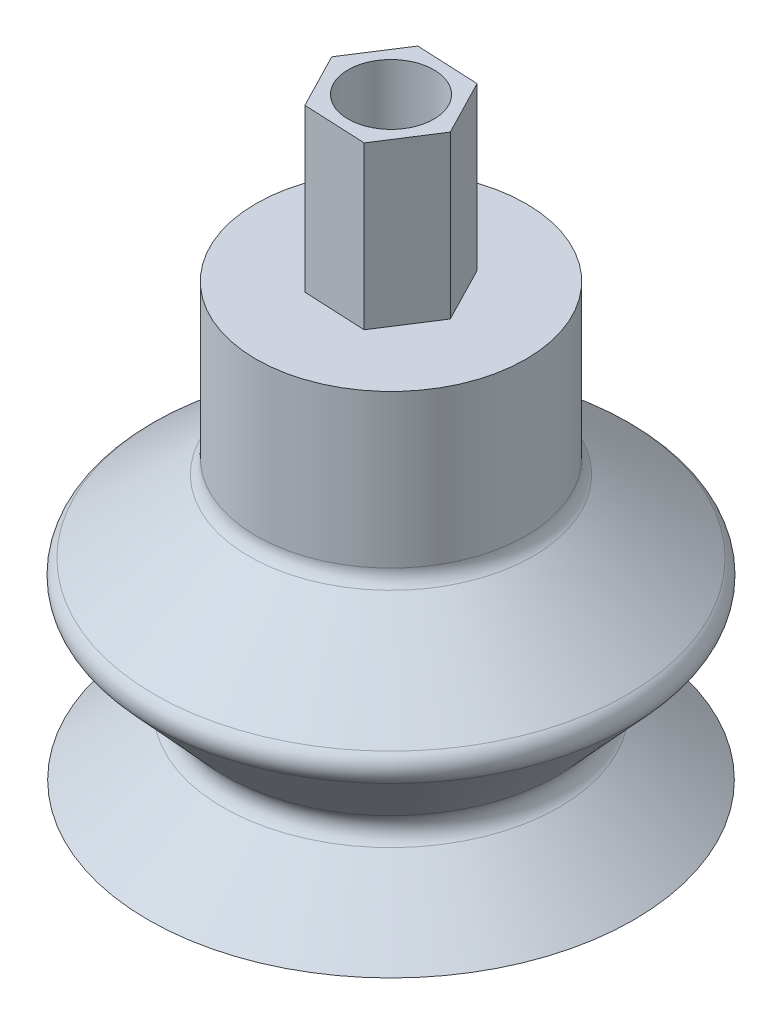
ISO-10303-21;
HEADER;
FILE_DESCRIPTION(('STEP AP214'),'2;1');
FILE_NAME('part.step','',(''),(''),'','','');
FILE_SCHEMA(('AUTOMOTIVE_DESIGN { 1 0 10303 214 1 1 1 1 }'));
ENDSEC;
DATA;
#1=APPLICATION_CONTEXT('core data for automotive mechanical design processes');
#2=APPLICATION_PROTOCOL_DEFINITION('international standard','automotive_design',2000,#1);
#3=PRODUCT_CONTEXT('',#1,'mechanical');
#4=PRODUCT('Part','Part','',(#3));
#5=PRODUCT_RELATED_PRODUCT_CATEGORY('part','',(#4));
#6=PRODUCT_DEFINITION_FORMATION('','',#4);
#7=PRODUCT_DEFINITION_CONTEXT('part definition',#1,'design');
#8=PRODUCT_DEFINITION('design','',#6,#7);
#9=PRODUCT_DEFINITION_SHAPE('','',#8);
#10=(LENGTH_UNIT() NAMED_UNIT(*) SI_UNIT(.MILLI.,.METRE.));
#11=(NAMED_UNIT(*) PLANE_ANGLE_UNIT() SI_UNIT($,.RADIAN.));
#12=(NAMED_UNIT(*) SI_UNIT($,.STERADIAN.) SOLID_ANGLE_UNIT());
#13=UNCERTAINTY_MEASURE_WITH_UNIT(LENGTH_MEASURE(1.E-05),#10,'distance_accuracy_value','');
#14=(GEOMETRIC_REPRESENTATION_CONTEXT(3) GLOBAL_UNCERTAINTY_ASSIGNED_CONTEXT((#13)) GLOBAL_UNIT_ASSIGNED_CONTEXT((#10,
#11,#12)) REPRESENTATION_CONTEXT('',''));
#15=CARTESIAN_POINT('',(0.,0.,0.));
#16=DIRECTION('',(0.,0.,1.));
#17=DIRECTION('',(1.,0.,0.));
#18=AXIS2_PLACEMENT_3D('',#15,#16,#17);
#19=CARTESIAN_POINT('',(0.,33.,0.));
#20=DIRECTION('',(0.,1.,0.));
#21=DIRECTION('',(0.,0.,1.));
#22=AXIS2_PLACEMENT_3D('',#19,#20,#21);
#23=PLANE('',#22);
#24=CARTESIAN_POINT('',(0.,33.,0.));
#25=DIRECTION('',(0.,1.,0.));
#26=DIRECTION('',(0.,0.,1.));
#27=AXIS2_PLACEMENT_3D('',#24,#25,#26);
#28=CIRCLE('',#27,2.38125);
#29=CARTESIAN_POINT('',(0.,33.,2.38125));
#30=VERTEX_POINT('',#29);
#31=EDGE_CURVE('E137',#30,#30,#28,.T.);
#32=ORIENTED_EDGE('',*,*,#31,.F.);
#33=EDGE_LOOP('',(#32));
#34=FACE_BOUND('',#33,.T.);
#35=DIRECTION('',(0.458306437489919,0.,0.88879424466819));
#36=VECTOR('',#35,1.);
#37=CARTESIAN_POINT('',(-3.460192769173,33.,-0.164517476770354));
#38=LINE('',#37,#36);
#39=CARTESIAN_POINT('',(-3.460192769173,33.,-0.164517476770354));
#40=VERTEX_POINT('',#39);
#41=CARTESIAN_POINT('',(-1.87257269883614,33.,2.91435610170987));
#42=VERTEX_POINT('',#41);
#43=EDGE_CURVE('E113',#40,#42,#38,.T.);
#44=ORIENTED_EDGE('',*,*,#43,.T.);
#45=DIRECTION('',(0.998871613365014,0.,0.0474921047498806));
#46=VECTOR('',#45,1.);
#47=CARTESIAN_POINT('',(-1.87257269883614,33.,2.91435610170987));
#48=LINE('',#47,#46);
#49=CARTESIAN_POINT('',(1.58762007033686,33.,3.07887357848022));
#50=VERTEX_POINT('',#49);
#51=EDGE_CURVE('E127',#42,#50,#48,.T.);
#52=ORIENTED_EDGE('',*,*,#51,.T.);
#53=DIRECTION('',(0.540565175875095,0.,-0.84130213991831));
#54=VECTOR('',#53,1.);
#55=CARTESIAN_POINT('',(1.58762007033686,33.,3.07887357848022));
#56=LINE('',#55,#54);
#57=CARTESIAN_POINT('',(3.460192769173,33.,0.164517476770354));
#58=VERTEX_POINT('',#57);
#59=EDGE_CURVE('E97',#50,#58,#56,.T.);
#60=ORIENTED_EDGE('',*,*,#59,.T.);
#61=DIRECTION('',(-0.458306437489919,0.,-0.88879424466819));
#62=VECTOR('',#61,1.);
#63=CARTESIAN_POINT('',(3.460192769173,33.,0.164517476770354));
#64=LINE('',#63,#62);
#65=CARTESIAN_POINT('',(1.87257269883614,33.,-2.91435610170987));
#66=VERTEX_POINT('',#65);
#67=EDGE_CURVE('E53',#58,#66,#64,.T.);
#68=ORIENTED_EDGE('',*,*,#67,.T.);
#69=DIRECTION('',(-0.998871613365014,0.,-0.0474921047498808));
#70=VECTOR('',#69,1.);
#71=CARTESIAN_POINT('',(1.87257269883614,33.,-2.91435610170987));
#72=LINE('',#71,#70);
#73=CARTESIAN_POINT('',(-1.58762007033686,33.,-3.07887357848022));
#74=VERTEX_POINT('',#73);
#75=EDGE_CURVE('E131',#66,#74,#72,.T.);
#76=ORIENTED_EDGE('',*,*,#75,.T.);
#77=DIRECTION('',(-0.540565175875096,0.,0.84130213991831));
#78=VECTOR('',#77,1.);
#79=CARTESIAN_POINT('',(-1.58762007033686,33.,-3.07887357848022));
#80=LINE('',#79,#78);
#81=EDGE_CURVE('E116',#74,#40,#80,.T.);
#82=ORIENTED_EDGE('',*,*,#81,.T.);
#83=EDGE_LOOP('',(#44,#52,#60,#68,#76,#82));
#84=FACE_BOUND('',#83,.T.);
#85=ADVANCED_FACE('F38',(#34,#84),#23,.T.);
#86=CARTESIAN_POINT('',(7.5,24.,0.));
#87=DIRECTION('',(0.,-1.,0.));
#88=DIRECTION('',(1.,0.,0.));
#89=AXIS2_PLACEMENT_3D('',#86,#87,#88);
#90=PLANE('',#89);
#91=CARTESIAN_POINT('',(0.,24.,0.));
#92=DIRECTION('',(0.,1.,0.));
#93=DIRECTION('',(-1.,0.,0.));
#94=AXIS2_PLACEMENT_3D('',#91,#92,#93);
#95=CIRCLE('',#94,7.5);
#96=CARTESIAN_POINT('',(-7.5,24.,0.));
#97=VERTEX_POINT('',#96);
#98=EDGE_CURVE('E165',#97,#97,#95,.T.);
#99=ORIENTED_EDGE('',*,*,#98,.T.);
#100=EDGE_LOOP('',(#99));
#101=FACE_BOUND('',#100,.T.);
#102=DIRECTION('',(0.458306437489919,0.,0.88879424466819));
#103=VECTOR('',#102,1.);
#104=CARTESIAN_POINT('',(-3.460192769173,24.,-0.164517476770354));
#105=LINE('',#104,#103);
#106=CARTESIAN_POINT('',(-3.460192769173,24.,-0.164517476770354));
#107=VERTEX_POINT('',#106);
#108=CARTESIAN_POINT('',(-1.87257269883614,24.,2.91435610170987));
#109=VERTEX_POINT('',#108);
#110=EDGE_CURVE('E103',#107,#109,#105,.T.);
#111=ORIENTED_EDGE('',*,*,#110,.F.);
#112=DIRECTION('',(-0.540565175875096,0.,0.84130213991831));
#113=VECTOR('',#112,1.);
#114=CARTESIAN_POINT('',(-1.58762007033686,24.,-3.07887357848022));
#115=LINE('',#114,#113);
#116=CARTESIAN_POINT('',(-1.58762007033686,24.,-3.07887357848022));
#117=VERTEX_POINT('',#116);
#118=EDGE_CURVE('E123',#117,#107,#115,.T.);
#119=ORIENTED_EDGE('',*,*,#118,.F.);
#120=DIRECTION('',(-0.998871613365014,0.,-0.0474921047498808));
#121=VECTOR('',#120,1.);
#122=CARTESIAN_POINT('',(1.87257269883614,24.,-2.91435610170987));
#123=LINE('',#122,#121);
#124=CARTESIAN_POINT('',(1.87257269883614,24.,-2.91435610170987));
#125=VERTEX_POINT('',#124);
#126=EDGE_CURVE('E120',#125,#117,#123,.T.);
#127=ORIENTED_EDGE('',*,*,#126,.F.);
#128=DIRECTION('',(-0.458306437489919,0.,-0.88879424466819));
#129=VECTOR('',#128,1.);
#130=CARTESIAN_POINT('',(3.460192769173,24.,0.164517476770354));
#131=LINE('',#130,#129);
#132=CARTESIAN_POINT('',(3.460192769173,24.,0.164517476770354));
#133=VERTEX_POINT('',#132);
#134=EDGE_CURVE('E61',#133,#125,#131,.T.);
#135=ORIENTED_EDGE('',*,*,#134,.F.);
#136=DIRECTION('',(0.540565175875095,0.,-0.84130213991831));
#137=VECTOR('',#136,1.);
#138=CARTESIAN_POINT('',(1.58762007033686,24.,3.07887357848022));
#139=LINE('',#138,#137);
#140=CARTESIAN_POINT('',(1.58762007033686,24.,3.07887357848022));
#141=VERTEX_POINT('',#140);
#142=EDGE_CURVE('E95',#141,#133,#139,.T.);
#143=ORIENTED_EDGE('',*,*,#142,.F.);
#144=DIRECTION('',(0.998871613365014,0.,0.0474921047498806));
#145=VECTOR('',#144,1.);
#146=CARTESIAN_POINT('',(-1.87257269883614,24.,2.91435610170987));
#147=LINE('',#146,#145);
#148=EDGE_CURVE('E108',#109,#141,#147,.T.);
#149=ORIENTED_EDGE('',*,*,#148,.F.);
#150=EDGE_LOOP('',(#111,#119,#127,#135,#143,#149));
#151=FACE_BOUND('',#150,.T.);
#152=ADVANCED_FACE('F107',(#101,#151),#90,.F.);
#153=CARTESIAN_POINT('',(0.,0.,0.));
#154=DIRECTION('',(0.,1.,0.));
#155=DIRECTION('',(-1.,0.,0.));
#156=AXIS2_PLACEMENT_3D('',#153,#154,#155);
#157=PLANE('',#156);
#158=CARTESIAN_POINT('',(0.,0.,0.));
#159=DIRECTION('',(0.,1.,0.));
#160=DIRECTION('',(-1.,0.,0.));
#161=AXIS2_PLACEMENT_3D('',#158,#159,#160);
#162=CIRCLE('',#161,12.0592970465776);
#163=CARTESIAN_POINT('',(-12.0592970465776,0.,0.));
#164=VERTEX_POINT('',#163);
#165=EDGE_CURVE('E154',#164,#164,#162,.T.);
#166=ORIENTED_EDGE('',*,*,#165,.T.);
#167=EDGE_LOOP('',(#166));
#168=FACE_BOUND('',#167,.T.);
#169=CARTESIAN_POINT('',(0.,0.,0.));
#170=DIRECTION('',(0.,1.,0.));
#171=DIRECTION('',(-1.,0.,0.));
#172=AXIS2_PLACEMENT_3D('',#169,#170,#171);
#173=CIRCLE('',#172,13.5);
#174=CARTESIAN_POINT('',(-13.5,0.,0.));
#175=VERTEX_POINT('',#174);
#176=EDGE_CURVE('E168',#175,#175,#173,.T.);
#177=ORIENTED_EDGE('',*,*,#176,.F.);
#178=EDGE_LOOP('',(#177));
#179=FACE_BOUND('',#178,.T.);
#180=ADVANCED_FACE('F214',(#168,#179),#157,.F.);
#181=CARTESIAN_POINT('',(0.,0.,0.));
#182=DIRECTION('',(0.,-1.,0.));
#183=DIRECTION('',(1.,0.,0.));
#184=AXIS2_PLACEMENT_3D('',#181,#182,#183);
#185=CONICAL_SURFACE('',#184,13.5,0.896055384571344);
#186=CARTESIAN_POINT('',(0.,3.33184473348769,0.));
#187=DIRECTION('',(0.,-1.,0.));
#188=DIRECTION('',(1.,0.,0.));
#189=AXIS2_PLACEMENT_3D('',#186,#187,#188);
#190=CIRCLE('',#189,9.33519408314038);
#191=CARTESIAN_POINT('',(9.33519408314038,3.3318447334877,0.));
#192=VERTEX_POINT('',#191);
#193=EDGE_CURVE('E11',#192,#192,#190,.T.);
#194=ORIENTED_EDGE('',*,*,#193,.T.);
#195=EDGE_LOOP('',(#194));
#196=FACE_BOUND('',#195,.T.);
#197=ORIENTED_EDGE('',*,*,#176,.T.);
#198=EDGE_LOOP('',(#197));
#199=FACE_BOUND('',#198,.T.);
#200=ADVANCED_FACE('F206',(#196,#199),#185,.T.);
#201=CARTESIAN_POINT('',(0.,4.,0.));
#202=DIRECTION('',(0.,1.,0.));
#203=DIRECTION('',(-1.,0.,0.));
#204=AXIS2_PLACEMENT_3D('',#201,#202,#203);
#205=CONICAL_SURFACE('',#204,8.5,0.741947268005917);
#206=CARTESIAN_POINT('',(0.,9.19635647057557,0.));
#207=DIRECTION('',(0.,-1.,0.));
#208=DIRECTION('',(1.,0.,0.));
#209=AXIS2_PLACEMENT_3D('',#206,#207,#208);
#210=CIRCLE('',#209,13.2633267646943);
#211=CARTESIAN_POINT('',(13.2633267646943,9.19635647057557,0.));
#212=VERTEX_POINT('',#211);
#213=EDGE_CURVE('E46',#212,#212,#210,.T.);
#214=ORIENTED_EDGE('',*,*,#213,.T.);
#215=EDGE_LOOP('',(#214));
#216=FACE_BOUND('',#215,.T.);
#217=CARTESIAN_POINT('',(0.,4.78843817144807,0.));
#218=DIRECTION('',(0.,1.,0.));
#219=DIRECTION('',(-1.,0.,0.));
#220=AXIS2_PLACEMENT_3D('',#217,#218,#219);
#221=CIRCLE('',#220,9.22273499049407);
#222=CARTESIAN_POINT('',(-9.22273499049407,4.78843817144807,0.));
#223=VERTEX_POINT('',#222);
#224=EDGE_CURVE('E180',#223,#223,#221,.T.);
#225=ORIENTED_EDGE('',*,*,#224,.T.);
#226=EDGE_LOOP('',(#225));
#227=FACE_BOUND('',#226,.T.);
#228=ADVANCED_FACE('F185',(#216,#227),#205,.T.);
#229=CARTESIAN_POINT('',(0.,10.,0.));
#230=DIRECTION('',(0.,-1.,0.));
#231=DIRECTION('',(1.,0.,0.));
#232=AXIS2_PLACEMENT_3D('',#229,#230,#231);
#233=CONICAL_SURFACE('',#232,14.,0.91510070055336);
#234=CARTESIAN_POINT('',(0.,14.6997775083459,0.));
#235=DIRECTION('',(0.,-1.,0.));
#236=DIRECTION('',(1.,0.,0.));
#237=AXIS2_PLACEMENT_3D('',#234,#235,#236);
#238=CIRCLE('',#237,7.8902892391503);
#239=CARTESIAN_POINT('',(7.8902892391503,14.6997775083459,0.));
#240=VERTEX_POINT('',#239);
#241=EDGE_CURVE('E177',#240,#240,#238,.T.);
#242=ORIENTED_EDGE('',*,*,#241,.T.);
#243=EDGE_LOOP('',(#242));
#244=FACE_BOUND('',#243,.T.);
#245=CARTESIAN_POINT('',(0.,10.6647050881975,0.));
#246=DIRECTION('',(0.,1.,0.));
#247=DIRECTION('',(-1.,0.,0.));
#248=AXIS2_PLACEMENT_3D('',#245,#246,#247);
#249=CIRCLE('',#248,13.1358833853432);
#250=CARTESIAN_POINT('',(-13.1358833853432,10.6647050881975,0.));
#251=VERTEX_POINT('',#250);
#252=EDGE_CURVE('E174',#251,#251,#249,.T.);
#253=ORIENTED_EDGE('',*,*,#252,.T.);
#254=EDGE_LOOP('',(#253));
#255=FACE_BOUND('',#254,.T.);
#256=ADVANCED_FACE('F194',(#244,#255),#233,.T.);
#257=CARTESIAN_POINT('',(0.,24.,0.));
#258=DIRECTION('',(0.,1.,0.));
#259=DIRECTION('',(-1.,0.,0.));
#260=AXIS2_PLACEMENT_3D('',#257,#258,#259);
#261=CYLINDRICAL_SURFACE('',#260,7.5);
#262=CARTESIAN_POINT('',(0.,15.4924014974505,0.));
#263=DIRECTION('',(0.,1.,0.));
#264=DIRECTION('',(-1.,0.,0.));
#265=AXIS2_PLACEMENT_3D('',#262,#263,#264);
#266=CIRCLE('',#265,7.5);
#267=CARTESIAN_POINT('',(-7.5,15.4924014974505,0.));
#268=VERTEX_POINT('',#267);
#269=EDGE_CURVE('E171',#268,#268,#266,.T.);
#270=ORIENTED_EDGE('',*,*,#269,.T.);
#271=EDGE_LOOP('',(#270));
#272=FACE_BOUND('',#271,.T.);
#273=ORIENTED_EDGE('',*,*,#98,.F.);
#274=EDGE_LOOP('',(#273));
#275=FACE_BOUND('',#274,.T.);
#276=ADVANCED_FACE('F196',(#272,#275),#261,.T.);
#277=CARTESIAN_POINT('',(0.,-0.702781928498727,0.));
#278=DIRECTION('',(0.,-1.,0.));
#279=DIRECTION('',(1.,0.,0.));
#280=AXIS2_PLACEMENT_3D('',#277,#278,#279);
#281=CONICAL_SURFACE('',#280,12.937774457201,0.896055384571344);
#282=CARTESIAN_POINT('',(0.,3.89855781136235,0.));
#283=DIRECTION('',(0.,1.,0.));
#284=DIRECTION('',(-1.,0.,0.));
#285=AXIS2_PLACEMENT_3D('',#282,#283,#284);
#286=CIRCLE('',#285,7.18609978237468);
#287=CARTESIAN_POINT('',(-7.18609978237468,3.89855781136235,0.));
#288=VERTEX_POINT('',#287);
#289=EDGE_CURVE('E151',#288,#288,#286,.T.);
#290=ORIENTED_EDGE('',*,*,#289,.T.);
#291=EDGE_LOOP('',(#290));
#292=FACE_BOUND('',#291,.T.);
#293=ORIENTED_EDGE('',*,*,#165,.F.);
#294=EDGE_LOOP('',(#293));
#295=FACE_BOUND('',#294,.T.);
#296=ADVANCED_FACE('F203',(#292,#295),#281,.F.);
#297=CARTESIAN_POINT('',(0.,4.60815216566561,0.));
#298=DIRECTION('',(0.,1.,0.));
#299=DIRECTION('',(-1.,0.,0.));
#300=AXIS2_PLACEMENT_3D('',#297,#298,#299);
#301=CONICAL_SURFACE('',#300,7.83656127381933,0.741947268005917);
#302=CARTESIAN_POINT('',(0.,9.88487298918363,0.));
#303=DIRECTION('',(0.,1.,0.));
#304=DIRECTION('',(-1.,0.,0.));
#305=AXIS2_PLACEMENT_3D('',#302,#303,#304);
#306=CIRCLE('',#305,12.6735553620442);
#307=CARTESIAN_POINT('',(-12.6735553620442,9.88487298918363,0.));
#308=VERTEX_POINT('',#307);
#309=EDGE_CURVE('E155',#308,#308,#306,.T.);
#310=ORIENTED_EDGE('',*,*,#309,.T.);
#311=EDGE_LOOP('',(#310));
#312=FACE_BOUND('',#311,.T.);
#313=ORIENTED_EDGE('',*,*,#289,.F.);
#314=EDGE_LOOP('',(#313));
#315=FACE_BOUND('',#314,.T.);
#316=ADVANCED_FACE('F225',(#312,#315),#301,.F.);
#317=CARTESIAN_POINT('',(0.,9.28663840980586,0.));
#318=DIRECTION('',(0.,-1.,0.));
#319=DIRECTION('',(1.,0.,0.));
#320=AXIS2_PLACEMENT_3D('',#317,#318,#319);
#321=CONICAL_SURFACE('',#320,13.4512603152353,0.91510070055336);
#322=CARTESIAN_POINT('',(0.,14.5568386522945,0.));
#323=DIRECTION('',(0.,-1.,0.));
#324=DIRECTION('',(1.,0.,0.));
#325=AXIS2_PLACEMENT_3D('',#322,#323,#324);
#326=CIRCLE('',#325,6.6);
#327=CARTESIAN_POINT('',(6.6,14.5568386522945,0.));
#328=VERTEX_POINT('',#327);
#329=EDGE_CURVE('E158',#328,#328,#326,.F.);
#330=ORIENTED_EDGE('',*,*,#329,.T.);
#331=EDGE_LOOP('',(#330));
#332=FACE_BOUND('',#331,.T.);
#333=ORIENTED_EDGE('',*,*,#309,.F.);
#334=EDGE_LOOP('',(#333));
#335=FACE_BOUND('',#334,.T.);
#336=ADVANCED_FACE('F229',(#332,#335),#321,.F.);
#337=CARTESIAN_POINT('',(0.,24.,0.));
#338=DIRECTION('',(0.,1.,0.));
#339=DIRECTION('',(-1.,0.,0.));
#340=AXIS2_PLACEMENT_3D('',#337,#338,#339);
#341=CYLINDRICAL_SURFACE('',#340,6.6);
#342=CARTESIAN_POINT('',(0.,23.1,0.));
#343=DIRECTION('',(0.,-1.,0.));
#344=DIRECTION('',(1.,0.,0.));
#345=AXIS2_PLACEMENT_3D('',#342,#343,#344);
#346=CIRCLE('',#345,6.6);
#347=CARTESIAN_POINT('',(6.6,23.1,0.));
#348=VERTEX_POINT('',#347);
#349=EDGE_CURVE('E150',#348,#348,#346,.F.);
#350=ORIENTED_EDGE('',*,*,#349,.T.);
#351=EDGE_LOOP('',(#350));
#352=FACE_BOUND('',#351,.T.);
#353=ORIENTED_EDGE('',*,*,#329,.F.);
#354=EDGE_LOOP('',(#353));
#355=FACE_BOUND('',#354,.T.);
#356=ADVANCED_FACE('F233',(#352,#355),#341,.F.);
#357=CARTESIAN_POINT('',(7.5,23.1,0.));
#358=DIRECTION('',(0.,-1.,0.));
#359=DIRECTION('',(1.,0.,0.));
#360=AXIS2_PLACEMENT_3D('',#357,#358,#359);
#361=PLANE('',#360);
#362=CARTESIAN_POINT('',(0.,23.1,0.));
#363=DIRECTION('',(0.,-1.,0.));
#364=DIRECTION('',(1.,0.,0.));
#365=AXIS2_PLACEMENT_3D('',#362,#363,#364);
#366=CIRCLE('',#365,2.38125);
#367=CARTESIAN_POINT('',(2.38125,23.1,0.));
#368=VERTEX_POINT('',#367);
#369=EDGE_CURVE('E147',#368,#368,#366,.T.);
#370=ORIENTED_EDGE('',*,*,#369,.F.);
#371=EDGE_LOOP('',(#370));
#372=FACE_BOUND('',#371,.T.);
#373=ORIENTED_EDGE('',*,*,#349,.F.);
#374=EDGE_LOOP('',(#373));
#375=FACE_BOUND('',#374,.T.);
#376=ADVANCED_FACE('F237',(#372,#375),#361,.T.);
#377=CARTESIAN_POINT('',(0.,15.4924014974505,0.));
#378=DIRECTION('',(0.,1.,0.));
#379=DIRECTION('',(-1.,0.,0.));
#380=AXIS2_PLACEMENT_3D('',#377,#378,#379);
#381=TOROIDAL_SURFACE('',#380,8.5,1.);
#382=ORIENTED_EDGE('',*,*,#241,.F.);
#383=EDGE_LOOP('',(#382));
#384=FACE_BOUND('',#383,.T.);
#385=ORIENTED_EDGE('',*,*,#269,.F.);
#386=EDGE_LOOP('',(#385));
#387=FACE_BOUND('',#386,.T.);
#388=ADVANCED_FACE('F191',(#384,#387),#381,.F.);
#389=CARTESIAN_POINT('',(0.,9.87208109909292,0.));
#390=DIRECTION('',(0.,-1.,0.));
#391=DIRECTION('',(1.,0.,0.));
#392=AXIS2_PLACEMENT_3D('',#389,#390,#391);
#393=TOROIDAL_SURFACE('',#392,12.5261726244935,1.);
#394=ORIENTED_EDGE('',*,*,#213,.F.);
#395=EDGE_LOOP('',(#394));
#396=FACE_BOUND('',#395,.T.);
#397=ORIENTED_EDGE('',*,*,#252,.F.);
#398=EDGE_LOOP('',(#397));
#399=FACE_BOUND('',#398,.T.);
#400=ADVANCED_FACE('F188',(#396,#399),#393,.T.);
#401=CARTESIAN_POINT('',(0.,4.11271354293073,0.));
#402=DIRECTION('',(0.,1.,0.));
#403=DIRECTION('',(-1.,0.,0.));
#404=AXIS2_PLACEMENT_3D('',#401,#402,#403);
#405=TOROIDAL_SURFACE('',#404,9.95988913069481,1.);
#406=ORIENTED_EDGE('',*,*,#193,.F.);
#407=EDGE_LOOP('',(#406));
#408=FACE_BOUND('',#407,.T.);
#409=ORIENTED_EDGE('',*,*,#224,.F.);
#410=EDGE_LOOP('',(#409));
#411=FACE_BOUND('',#410,.T.);
#412=ADVANCED_FACE('F40',(#408,#411),#405,.F.);
#413=CARTESIAN_POINT('',(0.,0.,0.));
#414=DIRECTION('',(0.,1.,0.));
#415=DIRECTION('',(0.,0.,1.));
#416=AXIS2_PLACEMENT_3D('',#413,#414,#415);
#417=CYLINDRICAL_SURFACE('',#416,2.38125);
#418=ORIENTED_EDGE('',*,*,#369,.T.);
#419=EDGE_LOOP('',(#418));
#420=FACE_BOUND('',#419,.T.);
#421=ORIENTED_EDGE('',*,*,#31,.T.);
#422=EDGE_LOOP('',(#421));
#423=FACE_BOUND('',#422,.T.);
#424=ADVANCED_FACE('F221',(#420,#423),#417,.F.);
#425=CARTESIAN_POINT('',(-1.87257269883614,24.,2.91435610170987));
#426=DIRECTION('',(-0.0474921047498806,0.,0.998871613365014));
#427=DIRECTION('',(0.998871613365014,0.,0.0474921047498806));
#428=AXIS2_PLACEMENT_3D('',#425,#426,#427);
#429=PLANE('',#428);
#430=ORIENTED_EDGE('',*,*,#51,.F.);
#431=DIRECTION('',(0.,1.,0.));
#432=VECTOR('',#431,1.);
#433=CARTESIAN_POINT('',(-1.87257269883614,24.,2.91435610170987));
#434=LINE('',#433,#432);
#435=EDGE_CURVE('E112',#109,#42,#434,.T.);
#436=ORIENTED_EDGE('',*,*,#435,.F.);
#437=ORIENTED_EDGE('',*,*,#148,.T.);
#438=DIRECTION('',(0.,1.,0.));
#439=VECTOR('',#438,1.);
#440=CARTESIAN_POINT('',(1.58762007033686,24.,3.07887357848022));
#441=LINE('',#440,#439);
#442=EDGE_CURVE('E93',#141,#50,#441,.T.);
#443=ORIENTED_EDGE('',*,*,#442,.T.);
#444=EDGE_LOOP('',(#430,#436,#437,#443));
#445=FACE_BOUND('',#444,.T.);
#446=ADVANCED_FACE('F111',(#445),#429,.T.);
#447=CARTESIAN_POINT('',(-3.460192769173,24.,-0.164517476770354));
#448=DIRECTION('',(-0.88879424466819,0.,0.458306437489919));
#449=DIRECTION('',(0.458306437489919,0.,0.88879424466819));
#450=AXIS2_PLACEMENT_3D('',#447,#448,#449);
#451=PLANE('',#450);
#452=ORIENTED_EDGE('',*,*,#43,.F.);
#453=DIRECTION('',(0.,1.,0.));
#454=VECTOR('',#453,1.);
#455=CARTESIAN_POINT('',(-3.460192769173,24.,-0.164517476770354));
#456=LINE('',#455,#454);
#457=EDGE_CURVE('E138',#107,#40,#456,.T.);
#458=ORIENTED_EDGE('',*,*,#457,.F.);
#459=ORIENTED_EDGE('',*,*,#110,.T.);
#460=ORIENTED_EDGE('',*,*,#435,.T.);
#461=EDGE_LOOP('',(#452,#458,#459,#460));
#462=FACE_BOUND('',#461,.T.);
#463=ADVANCED_FACE('F280',(#462),#451,.T.);
#464=CARTESIAN_POINT('',(-1.58762007033686,24.,-3.07887357848022));
#465=DIRECTION('',(-0.841302139918309,0.,-0.540565175875095));
#466=DIRECTION('',(-0.540565175875096,0.,0.84130213991831));
#467=AXIS2_PLACEMENT_3D('',#464,#465,#466);
#468=PLANE('',#467);
#469=ORIENTED_EDGE('',*,*,#81,.F.);
#470=DIRECTION('',(0.,1.,0.));
#471=VECTOR('',#470,1.);
#472=CARTESIAN_POINT('',(-1.58762007033686,24.,-3.07887357848022));
#473=LINE('',#472,#471);
#474=EDGE_CURVE('E140',#117,#74,#473,.T.);
#475=ORIENTED_EDGE('',*,*,#474,.F.);
#476=ORIENTED_EDGE('',*,*,#118,.T.);
#477=ORIENTED_EDGE('',*,*,#457,.T.);
#478=EDGE_LOOP('',(#469,#475,#476,#477));
#479=FACE_BOUND('',#478,.T.);
#480=ADVANCED_FACE('F285',(#479),#468,.T.);
#481=CARTESIAN_POINT('',(1.87257269883614,24.,-2.91435610170987));
#482=DIRECTION('',(0.0474921047498808,0.,-0.998871613365014));
#483=DIRECTION('',(-0.998871613365014,0.,-0.0474921047498808));
#484=AXIS2_PLACEMENT_3D('',#481,#482,#483);
#485=PLANE('',#484);
#486=ORIENTED_EDGE('',*,*,#75,.F.);
#487=DIRECTION('',(0.,1.,0.));
#488=VECTOR('',#487,1.);
#489=CARTESIAN_POINT('',(1.87257269883614,24.,-2.91435610170987));
#490=LINE('',#489,#488);
#491=EDGE_CURVE('E142',#125,#66,#490,.T.);
#492=ORIENTED_EDGE('',*,*,#491,.F.);
#493=ORIENTED_EDGE('',*,*,#126,.T.);
#494=ORIENTED_EDGE('',*,*,#474,.T.);
#495=EDGE_LOOP('',(#486,#492,#493,#494));
#496=FACE_BOUND('',#495,.T.);
#497=ADVANCED_FACE('F294',(#496),#485,.T.);
#498=CARTESIAN_POINT('',(3.460192769173,24.,0.164517476770354));
#499=DIRECTION('',(0.888794244668191,0.,-0.458306437489919));
#500=DIRECTION('',(-0.458306437489919,0.,-0.888794244668191));
#501=AXIS2_PLACEMENT_3D('',#498,#499,#500);
#502=PLANE('',#501);
#503=ORIENTED_EDGE('',*,*,#67,.F.);
#504=DIRECTION('',(0.,1.,0.));
#505=VECTOR('',#504,1.);
#506=CARTESIAN_POINT('',(3.460192769173,24.,0.164517476770354));
#507=LINE('',#506,#505);
#508=EDGE_CURVE('E102',#133,#58,#507,.T.);
#509=ORIENTED_EDGE('',*,*,#508,.F.);
#510=ORIENTED_EDGE('',*,*,#134,.T.);
#511=ORIENTED_EDGE('',*,*,#491,.T.);
#512=EDGE_LOOP('',(#503,#509,#510,#511));
#513=FACE_BOUND('',#512,.T.);
#514=ADVANCED_FACE('F291',(#513),#502,.T.);
#515=CARTESIAN_POINT('',(1.58762007033686,24.,3.07887357848022));
#516=DIRECTION('',(0.84130213991831,0.,0.540565175875095));
#517=DIRECTION('',(0.540565175875095,0.,-0.84130213991831));
#518=AXIS2_PLACEMENT_3D('',#515,#516,#517);
#519=PLANE('',#518);
#520=ORIENTED_EDGE('',*,*,#59,.F.);
#521=ORIENTED_EDGE('',*,*,#442,.F.);
#522=ORIENTED_EDGE('',*,*,#142,.T.);
#523=ORIENTED_EDGE('',*,*,#508,.T.);
#524=EDGE_LOOP('',(#520,#521,#522,#523));
#525=FACE_BOUND('',#524,.T.);
#526=ADVANCED_FACE('F94',(#525),#519,.T.);
#527=CLOSED_SHELL('',(#85,#152,#180,#200,#228,#256,#276,#296,#316,#336,#356,#376,#388,#400,#412,
#424,#446,#463,#480,#497,#514,#526));
#528=MANIFOLD_SOLID_BREP('B2',#527);
#529=ADVANCED_BREP_SHAPE_REPRESENTATION('',(#18,#528),#14);
#530=SHAPE_DEFINITION_REPRESENTATION(#9,#529);
ENDSEC;
END-ISO-10303-21;
